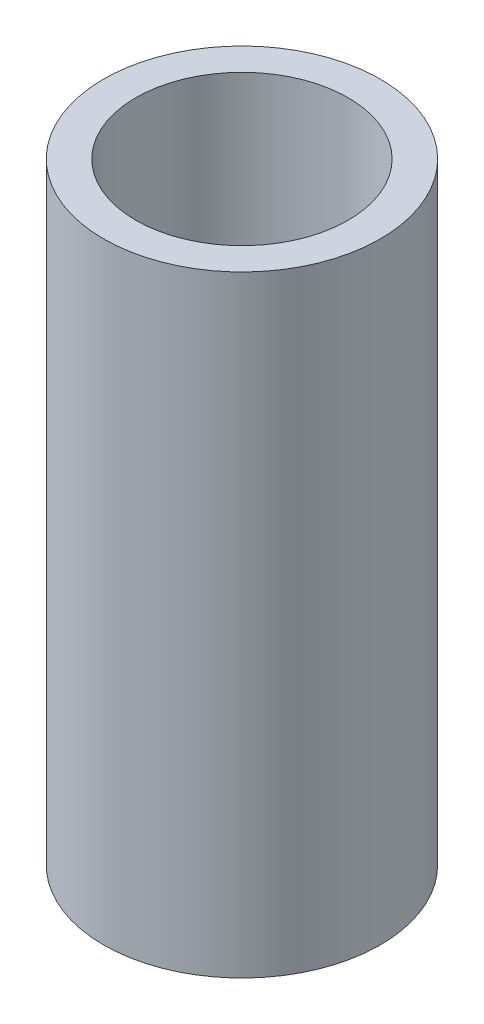
ISO-10303-21;
HEADER;
FILE_DESCRIPTION(('STEP AP214'),'2;1');
FILE_NAME('part.step','',(''),(''),'','','');
FILE_SCHEMA(('AUTOMOTIVE_DESIGN { 1 0 10303 214 1 1 1 1 }'));
ENDSEC;
DATA;
#1=APPLICATION_CONTEXT('core data for automotive mechanical design processes');
#2=APPLICATION_PROTOCOL_DEFINITION('international standard','automotive_design',2000,#1);
#3=PRODUCT_CONTEXT('',#1,'mechanical');
#4=PRODUCT('Part','Part','',(#3));
#5=PRODUCT_RELATED_PRODUCT_CATEGORY('part','',(#4));
#6=PRODUCT_DEFINITION_FORMATION('','',#4);
#7=PRODUCT_DEFINITION_CONTEXT('part definition',#1,'design');
#8=PRODUCT_DEFINITION('design','',#6,#7);
#9=PRODUCT_DEFINITION_SHAPE('','',#8);
#10=(LENGTH_UNIT() NAMED_UNIT(*) SI_UNIT(.MILLI.,.METRE.));
#11=(NAMED_UNIT(*) PLANE_ANGLE_UNIT() SI_UNIT($,.RADIAN.));
#12=(NAMED_UNIT(*) SI_UNIT($,.STERADIAN.) SOLID_ANGLE_UNIT());
#13=UNCERTAINTY_MEASURE_WITH_UNIT(LENGTH_MEASURE(1.E-05),#10,'distance_accuracy_value','');
#14=(GEOMETRIC_REPRESENTATION_CONTEXT(3) GLOBAL_UNCERTAINTY_ASSIGNED_CONTEXT((#13)) GLOBAL_UNIT_ASSIGNED_CONTEXT((#10,
#11,#12)) REPRESENTATION_CONTEXT('',''));
#15=CARTESIAN_POINT('',(0.,0.,0.));
#16=DIRECTION('',(0.,0.,1.));
#17=DIRECTION('',(1.,0.,0.));
#18=AXIS2_PLACEMENT_3D('',#15,#16,#17);
#19=CARTESIAN_POINT('',(0.,9.5,0.));
#20=DIRECTION('',(0.,1.,0.));
#21=DIRECTION('',(0.,0.,1.));
#22=AXIS2_PLACEMENT_3D('',#19,#20,#21);
#23=PLANE('',#22);
#24=CARTESIAN_POINT('',(0.,9.5,0.));
#25=DIRECTION('',(0.,1.,0.));
#26=DIRECTION('',(0.,0.,1.));
#27=AXIS2_PLACEMENT_3D('',#24,#25,#26);
#28=CIRCLE('',#27,2.15);
#29=CARTESIAN_POINT('',(0.,9.5,2.15));
#30=VERTEX_POINT('',#29);
#31=EDGE_CURVE('E10',#30,#30,#28,.T.);
#32=ORIENTED_EDGE('',*,*,#31,.T.);
#33=EDGE_LOOP('',(#32));
#34=FACE_BOUND('',#33,.T.);
#35=CARTESIAN_POINT('',(0.,9.5,0.));
#36=DIRECTION('',(0.,1.,0.));
#37=DIRECTION('',(0.,0.,1.));
#38=AXIS2_PLACEMENT_3D('',#35,#36,#37);
#39=CIRCLE('',#38,1.65);
#40=CARTESIAN_POINT('',(0.,9.5,1.65));
#41=VERTEX_POINT('',#40);
#42=EDGE_CURVE('E45',#41,#41,#39,.T.);
#43=ORIENTED_EDGE('',*,*,#42,.F.);
#44=EDGE_LOOP('',(#43));
#45=FACE_BOUND('',#44,.T.);
#46=ADVANCED_FACE('F34',(#34,#45),#23,.T.);
#47=CARTESIAN_POINT('',(0.,0.,0.));
#48=DIRECTION('',(0.,1.,0.));
#49=DIRECTION('',(0.,0.,1.));
#50=AXIS2_PLACEMENT_3D('',#47,#48,#49);
#51=PLANE('',#50);
#52=CARTESIAN_POINT('',(0.,0.,0.));
#53=DIRECTION('',(0.,1.,0.));
#54=DIRECTION('',(0.,0.,1.));
#55=AXIS2_PLACEMENT_3D('',#52,#53,#54);
#56=CIRCLE('',#55,2.15);
#57=CARTESIAN_POINT('',(0.,0.,2.15));
#58=VERTEX_POINT('',#57);
#59=EDGE_CURVE('E38',#58,#58,#56,.T.);
#60=ORIENTED_EDGE('',*,*,#59,.F.);
#61=EDGE_LOOP('',(#60));
#62=FACE_BOUND('',#61,.T.);
#63=CARTESIAN_POINT('',(0.,0.,0.));
#64=DIRECTION('',(0.,1.,0.));
#65=DIRECTION('',(0.,0.,1.));
#66=AXIS2_PLACEMENT_3D('',#63,#64,#65);
#67=CIRCLE('',#66,1.65);
#68=CARTESIAN_POINT('',(0.,0.,1.65));
#69=VERTEX_POINT('',#68);
#70=EDGE_CURVE('E47',#69,#69,#67,.T.);
#71=ORIENTED_EDGE('',*,*,#70,.T.);
#72=EDGE_LOOP('',(#71));
#73=FACE_BOUND('',#72,.T.);
#74=ADVANCED_FACE('F57',(#62,#73),#51,.F.);
#75=CARTESIAN_POINT('',(0.,9.5,0.));
#76=DIRECTION('',(0.,-1.,0.));
#77=DIRECTION('',(0.,0.,-1.));
#78=AXIS2_PLACEMENT_3D('',#75,#76,#77);
#79=CYLINDRICAL_SURFACE('',#78,2.15);
#80=ORIENTED_EDGE('',*,*,#31,.F.);
#81=EDGE_LOOP('',(#80));
#82=FACE_BOUND('',#81,.T.);
#83=ORIENTED_EDGE('',*,*,#59,.T.);
#84=EDGE_LOOP('',(#83));
#85=FACE_BOUND('',#84,.T.);
#86=ADVANCED_FACE('F36',(#82,#85),#79,.T.);
#87=CARTESIAN_POINT('',(0.,9.5,0.));
#88=DIRECTION('',(0.,-1.,0.));
#89=DIRECTION('',(0.,0.,-1.));
#90=AXIS2_PLACEMENT_3D('',#87,#88,#89);
#91=CYLINDRICAL_SURFACE('',#90,1.65);
#92=ORIENTED_EDGE('',*,*,#42,.T.);
#93=EDGE_LOOP('',(#92));
#94=FACE_BOUND('',#93,.T.);
#95=ORIENTED_EDGE('',*,*,#70,.F.);
#96=EDGE_LOOP('',(#95));
#97=FACE_BOUND('',#96,.T.);
#98=ADVANCED_FACE('F53',(#94,#97),#91,.F.);
#99=CLOSED_SHELL('',(#46,#74,#86,#98));
#100=MANIFOLD_SOLID_BREP('B2',#99);
#101=ADVANCED_BREP_SHAPE_REPRESENTATION('',(#18,#100),#14);
#102=SHAPE_DEFINITION_REPRESENTATION(#9,#101);
ENDSEC;
END-ISO-10303-21;
